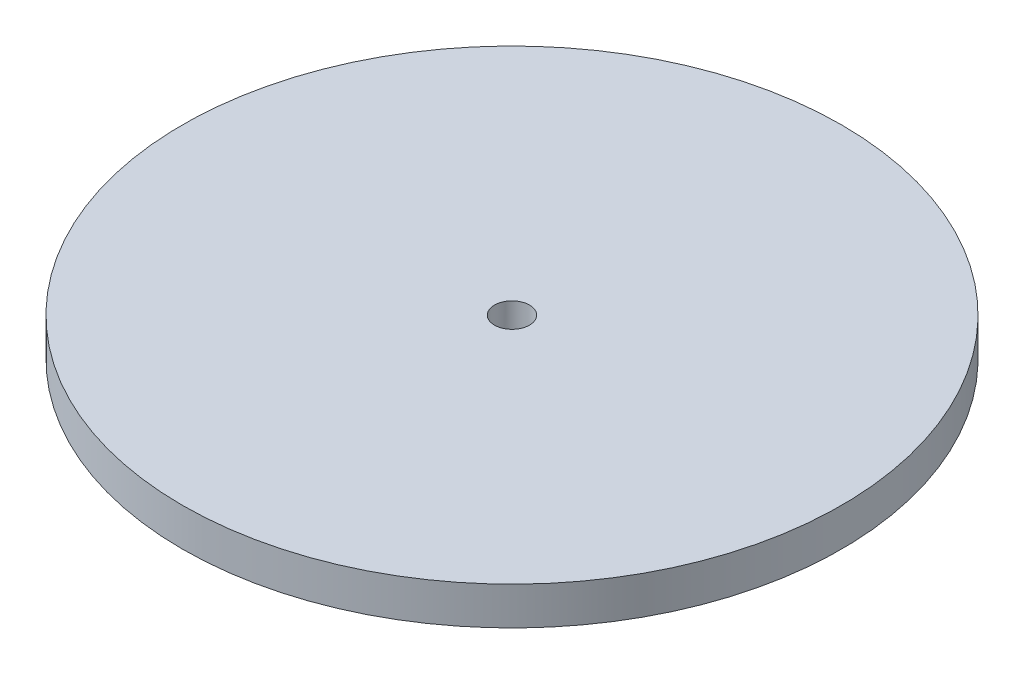
ISO-10303-21;
HEADER;
FILE_DESCRIPTION(('STEP AP214'),'2;1');
FILE_NAME('part.step','',(''),(''),'','','');
FILE_SCHEMA(('AUTOMOTIVE_DESIGN { 1 0 10303 214 1 1 1 1 }'));
ENDSEC;
DATA;
#1=APPLICATION_CONTEXT('core data for automotive mechanical design processes');
#2=APPLICATION_PROTOCOL_DEFINITION('international standard','automotive_design',2000,#1);
#3=PRODUCT_CONTEXT('',#1,'mechanical');
#4=PRODUCT('Part','Part','',(#3));
#5=PRODUCT_RELATED_PRODUCT_CATEGORY('part','',(#4));
#6=PRODUCT_DEFINITION_FORMATION('','',#4);
#7=PRODUCT_DEFINITION_CONTEXT('part definition',#1,'design');
#8=PRODUCT_DEFINITION('design','',#6,#7);
#9=PRODUCT_DEFINITION_SHAPE('','',#8);
#10=(LENGTH_UNIT() NAMED_UNIT(*) SI_UNIT(.MILLI.,.METRE.));
#11=(NAMED_UNIT(*) PLANE_ANGLE_UNIT() SI_UNIT($,.RADIAN.));
#12=(NAMED_UNIT(*) SI_UNIT($,.STERADIAN.) SOLID_ANGLE_UNIT());
#13=UNCERTAINTY_MEASURE_WITH_UNIT(LENGTH_MEASURE(1.E-05),#10,'distance_accuracy_value','');
#14=(GEOMETRIC_REPRESENTATION_CONTEXT(3) GLOBAL_UNCERTAINTY_ASSIGNED_CONTEXT((#13)) GLOBAL_UNIT_ASSIGNED_CONTEXT((#10,
#11,#12)) REPRESENTATION_CONTEXT('',''));
#15=CARTESIAN_POINT('',(0.,0.,0.));
#16=DIRECTION('',(0.,0.,1.));
#17=DIRECTION('',(1.,0.,0.));
#18=AXIS2_PLACEMENT_3D('',#15,#16,#17);
#19=CARTESIAN_POINT('',(0.,4.826,0.));
#20=DIRECTION('',(0.,-1.,0.));
#21=DIRECTION('',(0.,0.,-1.));
#22=AXIS2_PLACEMENT_3D('',#19,#20,#21);
#23=CYLINDRICAL_SURFACE('',#22,83.82);
#24=CARTESIAN_POINT('',(0.,4.826,0.));
#25=DIRECTION('',(0.,1.,0.));
#26=DIRECTION('',(0.,0.,1.));
#27=AXIS2_PLACEMENT_3D('',#24,#25,#26);
#28=CIRCLE('',#27,83.82);
#29=CARTESIAN_POINT('',(0.,4.826,83.82));
#30=VERTEX_POINT('',#29);
#31=EDGE_CURVE('E10',#30,#30,#28,.T.);
#32=ORIENTED_EDGE('',*,*,#31,.F.);
#33=EDGE_LOOP('',(#32));
#34=FACE_BOUND('',#33,.T.);
#35=CARTESIAN_POINT('',(0.,-4.826,0.));
#36=DIRECTION('',(0.,1.,0.));
#37=DIRECTION('',(0.,0.,1.));
#38=AXIS2_PLACEMENT_3D('',#35,#36,#37);
#39=CIRCLE('',#38,83.82);
#40=CARTESIAN_POINT('',(0.,-4.826,83.82));
#41=VERTEX_POINT('',#40);
#42=EDGE_CURVE('E41',#41,#41,#39,.T.);
#43=ORIENTED_EDGE('',*,*,#42,.T.);
#44=EDGE_LOOP('',(#43));
#45=FACE_BOUND('',#44,.T.);
#46=ADVANCED_FACE('F34',(#34,#45),#23,.T.);
#47=CARTESIAN_POINT('',(0.,4.826,0.));
#48=DIRECTION('',(0.,1.,0.));
#49=DIRECTION('',(0.,0.,1.));
#50=AXIS2_PLACEMENT_3D('',#47,#48,#49);
#51=PLANE('',#50);
#52=CARTESIAN_POINT('',(0.,4.826,0.));
#53=DIRECTION('',(0.,1.,0.));
#54=DIRECTION('',(0.,0.,1.));
#55=AXIS2_PLACEMENT_3D('',#52,#53,#54);
#56=CIRCLE('',#55,4.445);
#57=CARTESIAN_POINT('',(0.,4.826,4.445));
#58=VERTEX_POINT('',#57);
#59=EDGE_CURVE('E50',#58,#58,#56,.T.);
#60=ORIENTED_EDGE('',*,*,#59,.F.);
#61=EDGE_LOOP('',(#60));
#62=FACE_BOUND('',#61,.T.);
#63=ORIENTED_EDGE('',*,*,#31,.T.);
#64=EDGE_LOOP('',(#63));
#65=FACE_BOUND('',#64,.T.);
#66=ADVANCED_FACE('F68',(#62,#65),#51,.T.);
#67=CARTESIAN_POINT('',(0.,-4.826,0.));
#68=DIRECTION('',(0.,1.,0.));
#69=DIRECTION('',(0.,0.,1.));
#70=AXIS2_PLACEMENT_3D('',#67,#68,#69);
#71=PLANE('',#70);
#72=CARTESIAN_POINT('',(0.,-4.826,0.));
#73=DIRECTION('',(0.,-1.,0.));
#74=DIRECTION('',(0.,0.,-1.));
#75=AXIS2_PLACEMENT_3D('',#72,#73,#74);
#76=CIRCLE('',#75,19.2970404);
#77=CARTESIAN_POINT('',(0.,-4.826,-19.2970404));
#78=VERTEX_POINT('',#77);
#79=EDGE_CURVE('E46',#78,#78,#76,.T.);
#80=ORIENTED_EDGE('',*,*,#79,.F.);
#81=EDGE_LOOP('',(#80));
#82=FACE_BOUND('',#81,.T.);
#83=ORIENTED_EDGE('',*,*,#42,.F.);
#84=EDGE_LOOP('',(#83));
#85=FACE_BOUND('',#84,.T.);
#86=ADVANCED_FACE('F62',(#82,#85),#71,.F.);
#87=CARTESIAN_POINT('',(0.,-56.7254377387449,0.));
#88=DIRECTION('',(0.,-1.,0.));
#89=DIRECTION('',(0.,0.,-1.));
#90=AXIS2_PLACEMENT_3D('',#87,#88,#89);
#91=DEGENERATE_TOROIDAL_SURFACE('',#90,0.407171840974068,55.230234218,.T.);
#92=CARTESIAN_POINT('',(0.,-1.64300210329653,0.));
#93=DIRECTION('',(0.,-1.,0.));
#94=DIRECTION('',(0.,0.,-1.));
#95=AXIS2_PLACEMENT_3D('',#92,#93,#94);
#96=CIRCLE('',#95,4.445);
#97=CARTESIAN_POINT('',(0.,-1.64300210329653,-4.445));
#98=VERTEX_POINT('',#97);
#99=EDGE_CURVE('E37',#98,#98,#96,.T.);
#100=ORIENTED_EDGE('',*,*,#99,.F.);
#101=EDGE_LOOP('',(#100));
#102=FACE_BOUND('',#101,.T.);
#103=ORIENTED_EDGE('',*,*,#79,.T.);
#104=EDGE_LOOP('',(#103));
#105=FACE_BOUND('',#104,.T.);
#106=ADVANCED_FACE('F59',(#102,#105),#91,.F.);
#107=CARTESIAN_POINT('',(0.,-17.3983585694968,0.));
#108=DIRECTION('',(0.,1.,0.));
#109=DIRECTION('',(0.,0.,1.));
#110=AXIS2_PLACEMENT_3D('',#107,#108,#109);
#111=CYLINDRICAL_SURFACE('',#110,4.445);
#112=ORIENTED_EDGE('',*,*,#99,.T.);
#113=EDGE_LOOP('',(#112));
#114=FACE_BOUND('',#113,.T.);
#115=ORIENTED_EDGE('',*,*,#59,.T.);
#116=EDGE_LOOP('',(#115));
#117=FACE_BOUND('',#116,.T.);
#118=ADVANCED_FACE('F57',(#114,#117),#111,.F.);
#119=CLOSED_SHELL('',(#46,#66,#86,#106,#118));
#120=MANIFOLD_SOLID_BREP('B2',#119);
#121=ADVANCED_BREP_SHAPE_REPRESENTATION('',(#18,#120),#14);
#122=SHAPE_DEFINITION_REPRESENTATION(#9,#121);
ENDSEC;
END-ISO-10303-21;
